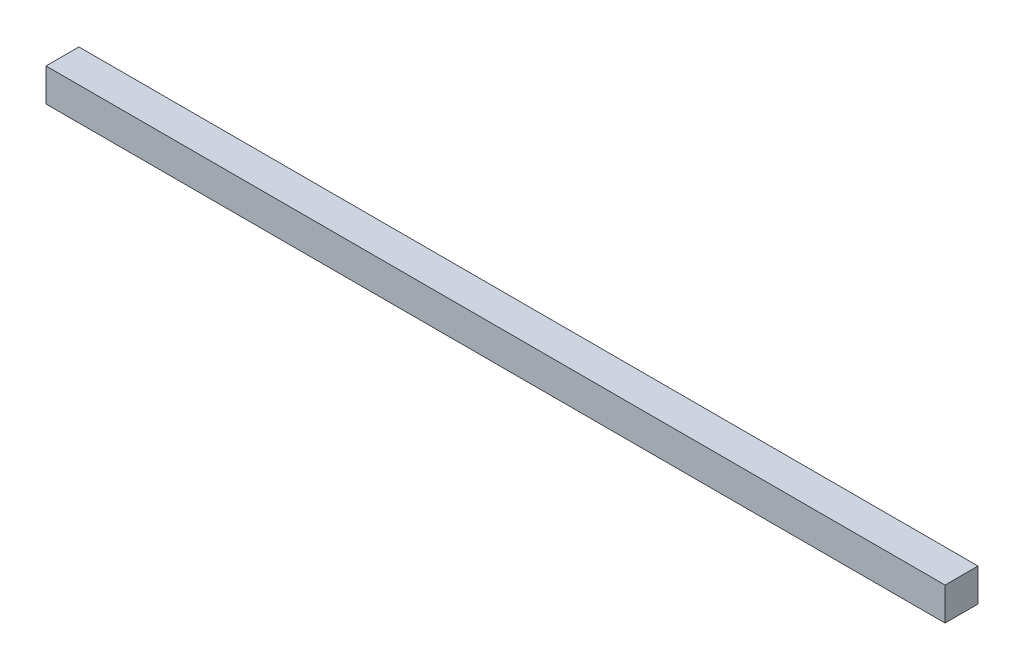
ISO-10303-21;
HEADER;
FILE_DESCRIPTION(('STEP AP214'),'2;1');
FILE_NAME('part.step','',(''),(''),'','','');
FILE_SCHEMA(('AUTOMOTIVE_DESIGN { 1 0 10303 214 1 1 1 1 }'));
ENDSEC;
DATA;
#1=APPLICATION_CONTEXT('core data for automotive mechanical design processes');
#2=APPLICATION_PROTOCOL_DEFINITION('international standard','automotive_design',2000,#1);
#3=PRODUCT_CONTEXT('',#1,'mechanical');
#4=PRODUCT('Part','Part','',(#3));
#5=PRODUCT_RELATED_PRODUCT_CATEGORY('part','',(#4));
#6=PRODUCT_DEFINITION_FORMATION('','',#4);
#7=PRODUCT_DEFINITION_CONTEXT('part definition',#1,'design');
#8=PRODUCT_DEFINITION('design','',#6,#7);
#9=PRODUCT_DEFINITION_SHAPE('','',#8);
#10=(LENGTH_UNIT() NAMED_UNIT(*) SI_UNIT(.MILLI.,.METRE.));
#11=(NAMED_UNIT(*) PLANE_ANGLE_UNIT() SI_UNIT($,.RADIAN.));
#12=(NAMED_UNIT(*) SI_UNIT($,.STERADIAN.) SOLID_ANGLE_UNIT());
#13=UNCERTAINTY_MEASURE_WITH_UNIT(LENGTH_MEASURE(1.E-05),#10,'distance_accuracy_value','');
#14=(GEOMETRIC_REPRESENTATION_CONTEXT(3) GLOBAL_UNCERTAINTY_ASSIGNED_CONTEXT((#13)) GLOBAL_UNIT_ASSIGNED_CONTEXT((#10,
#11,#12)) REPRESENTATION_CONTEXT('',''));
#15=CARTESIAN_POINT('',(0.,0.,0.));
#16=DIRECTION('',(0.,0.,1.));
#17=DIRECTION('',(1.,0.,0.));
#18=AXIS2_PLACEMENT_3D('',#15,#16,#17);
#19=CARTESIAN_POINT('',(-217.816611842105,74.7916666666666,10.));
#20=DIRECTION('',(1.,0.,0.));
#21=DIRECTION('',(0.,0.,-1.));
#22=AXIS2_PLACEMENT_3D('',#19,#20,#21);
#23=PLANE('',#22);
#24=DIRECTION('',(0.,-1.,0.));
#25=VECTOR('',#24,1.);
#26=CARTESIAN_POINT('',(-217.816611842105,74.7916666666666,0.));
#27=LINE('',#26,#25);
#28=CARTESIAN_POINT('',(-217.816611842105,74.7916666666666,0.));
#29=VERTEX_POINT('',#28);
#30=CARTESIAN_POINT('',(-217.816611842105,64.7916666666667,0.));
#31=VERTEX_POINT('',#30);
#32=EDGE_CURVE('E96',#29,#31,#27,.T.);
#33=ORIENTED_EDGE('',*,*,#32,.T.);
#34=DIRECTION('',(0.,0.,-1.));
#35=VECTOR('',#34,1.);
#36=CARTESIAN_POINT('',(-217.816611842105,64.7916666666667,10.));
#37=LINE('',#36,#35);
#38=CARTESIAN_POINT('',(-217.816611842105,64.7916666666667,10.));
#39=VERTEX_POINT('',#38);
#40=EDGE_CURVE('E11',#39,#31,#37,.T.);
#41=ORIENTED_EDGE('',*,*,#40,.F.);
#42=DIRECTION('',(0.,-1.,0.));
#43=VECTOR('',#42,1.);
#44=CARTESIAN_POINT('',(-217.816611842105,74.7916666666666,10.));
#45=LINE('',#44,#43);
#46=CARTESIAN_POINT('',(-217.816611842105,74.7916666666666,10.));
#47=VERTEX_POINT('',#46);
#48=EDGE_CURVE('E82',#47,#39,#45,.T.);
#49=ORIENTED_EDGE('',*,*,#48,.F.);
#50=DIRECTION('',(0.,0.,-1.));
#51=VECTOR('',#50,1.);
#52=CARTESIAN_POINT('',(-217.816611842105,74.7916666666666,10.));
#53=LINE('',#52,#51);
#54=EDGE_CURVE('E49',#47,#29,#53,.T.);
#55=ORIENTED_EDGE('',*,*,#54,.T.);
#56=EDGE_LOOP('',(#33,#41,#49,#55));
#57=FACE_BOUND('',#56,.T.);
#58=ADVANCED_FACE('F33',(#57),#23,.F.);
#59=CARTESIAN_POINT('',(-217.816611842105,64.7916666666667,10.));
#60=DIRECTION('',(0.,1.,0.));
#61=DIRECTION('',(0.,0.,1.));
#62=AXIS2_PLACEMENT_3D('',#59,#60,#61);
#63=PLANE('',#62);
#64=DIRECTION('',(1.,0.,0.));
#65=VECTOR('',#64,1.);
#66=CARTESIAN_POINT('',(-217.816611842105,64.7916666666667,0.));
#67=LINE('',#66,#65);
#68=CARTESIAN_POINT('',(55.1833881578948,64.7916666666667,0.));
#69=VERTEX_POINT('',#68);
#70=EDGE_CURVE('E87',#31,#69,#67,.T.);
#71=ORIENTED_EDGE('',*,*,#70,.T.);
#72=DIRECTION('',(0.,0.,-1.));
#73=VECTOR('',#72,1.);
#74=CARTESIAN_POINT('',(55.1833881578948,64.7916666666667,10.));
#75=LINE('',#74,#73);
#76=CARTESIAN_POINT('',(55.1833881578948,64.7916666666667,10.));
#77=VERTEX_POINT('',#76);
#78=EDGE_CURVE('E41',#77,#69,#75,.T.);
#79=ORIENTED_EDGE('',*,*,#78,.F.);
#80=DIRECTION('',(1.,0.,0.));
#81=VECTOR('',#80,1.);
#82=CARTESIAN_POINT('',(-217.816611842105,64.7916666666667,10.));
#83=LINE('',#82,#81);
#84=EDGE_CURVE('E74',#39,#77,#83,.T.);
#85=ORIENTED_EDGE('',*,*,#84,.F.);
#86=ORIENTED_EDGE('',*,*,#40,.T.);
#87=EDGE_LOOP('',(#71,#79,#85,#86));
#88=FACE_BOUND('',#87,.T.);
#89=ADVANCED_FACE('F86',(#88),#63,.F.);
#90=CARTESIAN_POINT('',(55.1833881578948,74.7916666666666,10.));
#91=DIRECTION('',(1.,0.,0.));
#92=DIRECTION('',(0.,0.,-1.));
#93=AXIS2_PLACEMENT_3D('',#90,#91,#92);
#94=PLANE('',#93);
#95=DIRECTION('',(0.,-1.,0.));
#96=VECTOR('',#95,1.);
#97=CARTESIAN_POINT('',(55.1833881578948,74.7916666666666,0.));
#98=LINE('',#97,#96);
#99=CARTESIAN_POINT('',(55.1833881578948,74.7916666666666,0.));
#100=VERTEX_POINT('',#99);
#101=EDGE_CURVE('E99',#100,#69,#98,.T.);
#102=ORIENTED_EDGE('',*,*,#101,.F.);
#103=DIRECTION('',(0.,0.,-1.));
#104=VECTOR('',#103,1.);
#105=CARTESIAN_POINT('',(55.1833881578948,74.7916666666666,10.));
#106=LINE('',#105,#104);
#107=CARTESIAN_POINT('',(55.1833881578948,74.7916666666666,10.));
#108=VERTEX_POINT('',#107);
#109=EDGE_CURVE('E63',#108,#100,#106,.T.);
#110=ORIENTED_EDGE('',*,*,#109,.F.);
#111=DIRECTION('',(0.,-1.,0.));
#112=VECTOR('',#111,1.);
#113=CARTESIAN_POINT('',(55.1833881578948,74.7916666666666,10.));
#114=LINE('',#113,#112);
#115=EDGE_CURVE('E81',#108,#77,#114,.T.);
#116=ORIENTED_EDGE('',*,*,#115,.T.);
#117=ORIENTED_EDGE('',*,*,#78,.T.);
#118=EDGE_LOOP('',(#102,#110,#116,#117));
#119=FACE_BOUND('',#118,.T.);
#120=ADVANCED_FACE('F90',(#119),#94,.T.);
#121=CARTESIAN_POINT('',(-217.816611842105,74.7916666666666,10.));
#122=DIRECTION('',(0.,1.,0.));
#123=DIRECTION('',(0.,0.,1.));
#124=AXIS2_PLACEMENT_3D('',#121,#122,#123);
#125=PLANE('',#124);
#126=DIRECTION('',(1.,0.,0.));
#127=VECTOR('',#126,1.);
#128=CARTESIAN_POINT('',(-217.816611842105,74.7916666666666,0.));
#129=LINE('',#128,#127);
#130=EDGE_CURVE('E101',#29,#100,#129,.T.);
#131=ORIENTED_EDGE('',*,*,#130,.F.);
#132=ORIENTED_EDGE('',*,*,#54,.F.);
#133=DIRECTION('',(1.,0.,0.));
#134=VECTOR('',#133,1.);
#135=CARTESIAN_POINT('',(-217.816611842105,74.7916666666666,10.));
#136=LINE('',#135,#134);
#137=EDGE_CURVE('E91',#47,#108,#136,.T.);
#138=ORIENTED_EDGE('',*,*,#137,.T.);
#139=ORIENTED_EDGE('',*,*,#109,.T.);
#140=EDGE_LOOP('',(#131,#132,#138,#139));
#141=FACE_BOUND('',#140,.T.);
#142=ADVANCED_FACE('F107',(#141),#125,.T.);
#143=CARTESIAN_POINT('',(0.,0.,10.));
#144=DIRECTION('',(0.,0.,1.));
#145=DIRECTION('',(1.,0.,0.));
#146=AXIS2_PLACEMENT_3D('',#143,#144,#145);
#147=PLANE('',#146);
#148=ORIENTED_EDGE('',*,*,#48,.T.);
#149=ORIENTED_EDGE('',*,*,#84,.T.);
#150=ORIENTED_EDGE('',*,*,#115,.F.);
#151=ORIENTED_EDGE('',*,*,#137,.F.);
#152=EDGE_LOOP('',(#148,#149,#150,#151));
#153=FACE_BOUND('',#152,.T.);
#154=ADVANCED_FACE('F78',(#153),#147,.T.);
#155=CARTESIAN_POINT('',(0.,0.,0.));
#156=DIRECTION('',(0.,0.,1.));
#157=DIRECTION('',(1.,0.,0.));
#158=AXIS2_PLACEMENT_3D('',#155,#156,#157);
#159=PLANE('',#158);
#160=ORIENTED_EDGE('',*,*,#32,.F.);
#161=ORIENTED_EDGE('',*,*,#130,.T.);
#162=ORIENTED_EDGE('',*,*,#101,.T.);
#163=ORIENTED_EDGE('',*,*,#70,.F.);
#164=EDGE_LOOP('',(#160,#161,#162,#163));
#165=FACE_BOUND('',#164,.T.);
#166=ADVANCED_FACE('F106',(#165),#159,.F.);
#167=CLOSED_SHELL('',(#58,#89,#120,#142,#154,#166));
#168=MANIFOLD_SOLID_BREP('B2',#167);
#169=ADVANCED_BREP_SHAPE_REPRESENTATION('',(#18,#168),#14);
#170=SHAPE_DEFINITION_REPRESENTATION(#9,#169);
ENDSEC;
END-ISO-10303-21;
